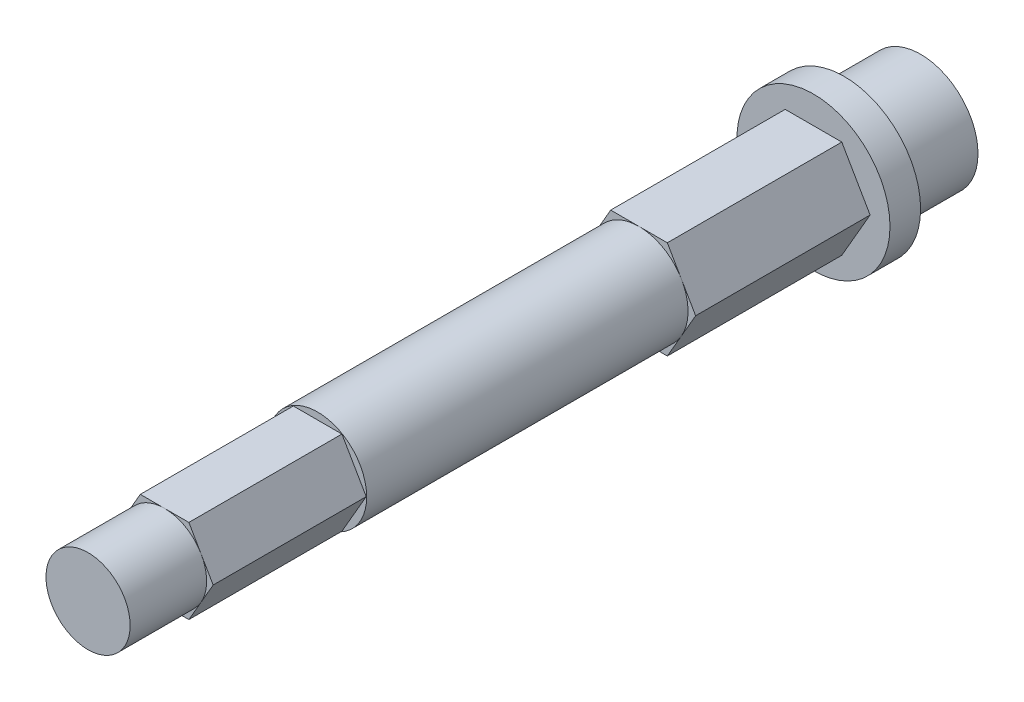
ISO-10303-21;
HEADER;
FILE_DESCRIPTION(('STEP AP214'),'2;1');
FILE_NAME('part.step','',(''),(''),'','','');
FILE_SCHEMA(('AUTOMOTIVE_DESIGN { 1 0 10303 214 1 1 1 1 }'));
ENDSEC;
DATA;
#1=APPLICATION_CONTEXT('core data for automotive mechanical design processes');
#2=APPLICATION_PROTOCOL_DEFINITION('international standard','automotive_design',2000,#1);
#3=PRODUCT_CONTEXT('',#1,'mechanical');
#4=PRODUCT('Part','Part','',(#3));
#5=PRODUCT_RELATED_PRODUCT_CATEGORY('part','',(#4));
#6=PRODUCT_DEFINITION_FORMATION('','',#4);
#7=PRODUCT_DEFINITION_CONTEXT('part definition',#1,'design');
#8=PRODUCT_DEFINITION('design','',#6,#7);
#9=PRODUCT_DEFINITION_SHAPE('','',#8);
#10=(LENGTH_UNIT() NAMED_UNIT(*) SI_UNIT(.MILLI.,.METRE.));
#11=(NAMED_UNIT(*) PLANE_ANGLE_UNIT() SI_UNIT($,.RADIAN.));
#12=(NAMED_UNIT(*) SI_UNIT($,.STERADIAN.) SOLID_ANGLE_UNIT());
#13=UNCERTAINTY_MEASURE_WITH_UNIT(LENGTH_MEASURE(1.E-05),#10,'distance_accuracy_value','');
#14=(GEOMETRIC_REPRESENTATION_CONTEXT(3) GLOBAL_UNCERTAINTY_ASSIGNED_CONTEXT((#13)) GLOBAL_UNIT_ASSIGNED_CONTEXT((#10,
#11,#12)) REPRESENTATION_CONTEXT('',''));
#15=CARTESIAN_POINT('',(0.,0.,0.));
#16=DIRECTION('',(0.,0.,1.));
#17=DIRECTION('',(1.,0.,0.));
#18=AXIS2_PLACEMENT_3D('',#15,#16,#17);
#19=CARTESIAN_POINT('',(0.,0.,49.4));
#20=DIRECTION('',(0.,0.,1.));
#21=DIRECTION('',(1.,0.,0.));
#22=AXIS2_PLACEMENT_3D('',#19,#20,#21);
#23=PLANE('',#22);
#24=CARTESIAN_POINT('',(0.,0.,49.4));
#25=DIRECTION('',(0.,0.,1.));
#26=DIRECTION('',(1.,0.,0.));
#27=AXIS2_PLACEMENT_3D('',#24,#25,#26);
#28=CIRCLE('',#27,2.74963065701559);
#29=CARTESIAN_POINT('',(2.38125,1.3748153285078,49.4));
#30=VERTEX_POINT('',#29);
#31=CARTESIAN_POINT('',(0.,2.74963065701559,49.4));
#32=VERTEX_POINT('',#31);
#33=EDGE_CURVE('E51',#30,#32,#28,.T.);
#34=ORIENTED_EDGE('',*,*,#33,.F.);
#35=DIRECTION('',(-0.5,0.866025403784439,0.));
#36=VECTOR('',#35,1.);
#37=CARTESIAN_POINT('',(3.175,0.,49.4));
#38=LINE('',#37,#36);
#39=CARTESIAN_POINT('',(1.5875,2.74963065701559,49.4));
#40=VERTEX_POINT('',#39);
#41=EDGE_CURVE('E181',#30,#40,#38,.T.);
#42=ORIENTED_EDGE('',*,*,#41,.T.);
#43=DIRECTION('',(-1.,0.,0.));
#44=VECTOR('',#43,1.);
#45=CARTESIAN_POINT('',(1.5875,2.74963065701559,49.4));
#46=LINE('',#45,#44);
#47=EDGE_CURVE('E195',#40,#32,#46,.T.);
#48=ORIENTED_EDGE('',*,*,#47,.T.);
#49=EDGE_LOOP('',(#34,#42,#48));
#50=FACE_BOUND('',#49,.T.);
#51=ADVANCED_FACE('F39',(#50),#23,.T.);
#52=CARTESIAN_POINT('',(-2.38125,1.3748153285078,49.4));
#53=VERTEX_POINT('',#52);
#54=EDGE_CURVE('E11',#32,#53,#28,.T.);
#55=ORIENTED_EDGE('',*,*,#54,.F.);
#56=CARTESIAN_POINT('',(-1.5875,2.74963065701559,49.4));
#57=VERTEX_POINT('',#56);
#58=EDGE_CURVE('E180',#32,#57,#46,.T.);
#59=ORIENTED_EDGE('',*,*,#58,.T.);
#60=DIRECTION('',(-0.5,-0.866025403784439,0.));
#61=VECTOR('',#60,1.);
#62=CARTESIAN_POINT('',(-1.5875,2.74963065701559,49.4));
#63=LINE('',#62,#61);
#64=EDGE_CURVE('E215',#57,#53,#63,.T.);
#65=ORIENTED_EDGE('',*,*,#64,.T.);
#66=EDGE_LOOP('',(#55,#59,#65));
#67=FACE_BOUND('',#66,.T.);
#68=ADVANCED_FACE('F389',(#67),#23,.T.);
#69=CARTESIAN_POINT('',(-2.38125,-1.3748153285078,49.4));
#70=VERTEX_POINT('',#69);
#71=EDGE_CURVE('E49',#53,#70,#28,.T.);
#72=ORIENTED_EDGE('',*,*,#71,.F.);
#73=CARTESIAN_POINT('',(-3.175,0.,49.4));
#74=VERTEX_POINT('',#73);
#75=EDGE_CURVE('E214',#53,#74,#63,.T.);
#76=ORIENTED_EDGE('',*,*,#75,.T.);
#77=DIRECTION('',(0.5,-0.866025403784439,0.));
#78=VECTOR('',#77,1.);
#79=CARTESIAN_POINT('',(-3.175,0.,49.4));
#80=LINE('',#79,#78);
#81=EDGE_CURVE('E220',#74,#70,#80,.T.);
#82=ORIENTED_EDGE('',*,*,#81,.T.);
#83=EDGE_LOOP('',(#72,#76,#82));
#84=FACE_BOUND('',#83,.T.);
#85=ADVANCED_FACE('F394',(#84),#23,.T.);
#86=CARTESIAN_POINT('',(0.,-2.74963065701559,49.4));
#87=VERTEX_POINT('',#86);
#88=EDGE_CURVE('E66',#70,#87,#28,.T.);
#89=ORIENTED_EDGE('',*,*,#88,.F.);
#90=CARTESIAN_POINT('',(-1.5875,-2.74963065701559,49.4));
#91=VERTEX_POINT('',#90);
#92=EDGE_CURVE('E219',#70,#91,#80,.T.);
#93=ORIENTED_EDGE('',*,*,#92,.T.);
#94=DIRECTION('',(1.,0.,0.));
#95=VECTOR('',#94,1.);
#96=CARTESIAN_POINT('',(-1.5875,-2.74963065701559,49.4));
#97=LINE('',#96,#95);
#98=EDGE_CURVE('E225',#91,#87,#97,.T.);
#99=ORIENTED_EDGE('',*,*,#98,.T.);
#100=EDGE_LOOP('',(#89,#93,#99));
#101=FACE_BOUND('',#100,.T.);
#102=ADVANCED_FACE('F411',(#101),#23,.T.);
#103=CARTESIAN_POINT('',(2.38125,-1.3748153285078,49.4));
#104=VERTEX_POINT('',#103);
#105=EDGE_CURVE('E58',#87,#104,#28,.T.);
#106=ORIENTED_EDGE('',*,*,#105,.F.);
#107=CARTESIAN_POINT('',(1.5875,-2.74963065701559,49.4));
#108=VERTEX_POINT('',#107);
#109=EDGE_CURVE('E224',#87,#108,#97,.T.);
#110=ORIENTED_EDGE('',*,*,#109,.T.);
#111=DIRECTION('',(0.5,0.866025403784439,0.));
#112=VECTOR('',#111,1.);
#113=CARTESIAN_POINT('',(1.5875,-2.74963065701559,49.4));
#114=LINE('',#113,#112);
#115=EDGE_CURVE('E193',#108,#104,#114,.T.);
#116=ORIENTED_EDGE('',*,*,#115,.T.);
#117=EDGE_LOOP('',(#106,#110,#116));
#118=FACE_BOUND('',#117,.T.);
#119=ADVANCED_FACE('F400',(#118),#23,.T.);
#120=CARTESIAN_POINT('',(0.,0.,18.4));
#121=DIRECTION('',(0.,0.,1.));
#122=DIRECTION('',(1.,0.,0.));
#123=AXIS2_PLACEMENT_3D('',#120,#121,#122);
#124=PLANE('',#123);
#125=CARTESIAN_POINT('',(0.,0.,18.4));
#126=DIRECTION('',(0.,0.,1.));
#127=DIRECTION('',(1.,0.,0.));
#128=AXIS2_PLACEMENT_3D('',#125,#126,#127);
#129=CIRCLE('',#128,3.20429399400242);
#130=CARTESIAN_POINT('',(2.775,1.60214699700121,18.4));
#131=VERTEX_POINT('',#130);
#132=CARTESIAN_POINT('',(0.,3.20429399400243,18.4));
#133=VERTEX_POINT('',#132);
#134=EDGE_CURVE('E207',#131,#133,#129,.T.);
#135=ORIENTED_EDGE('',*,*,#134,.F.);
#136=DIRECTION('',(-0.5,0.866025403784439,0.));
#137=VECTOR('',#136,1.);
#138=CARTESIAN_POINT('',(3.7,0.,18.4));
#139=LINE('',#138,#137);
#140=CARTESIAN_POINT('',(1.85,3.20429399400242,18.4));
#141=VERTEX_POINT('',#140);
#142=EDGE_CURVE('E284',#131,#141,#139,.T.);
#143=ORIENTED_EDGE('',*,*,#142,.T.);
#144=DIRECTION('',(-1.,0.,0.));
#145=VECTOR('',#144,1.);
#146=CARTESIAN_POINT('',(1.85,3.20429399400242,18.4));
#147=LINE('',#146,#145);
#148=EDGE_CURVE('E290',#141,#133,#147,.T.);
#149=ORIENTED_EDGE('',*,*,#148,.T.);
#150=EDGE_LOOP('',(#135,#143,#149));
#151=FACE_BOUND('',#150,.T.);
#152=ADVANCED_FACE('F410',(#151),#124,.T.);
#153=CARTESIAN_POINT('',(-2.775,1.60214699700121,18.4));
#154=VERTEX_POINT('',#153);
#155=EDGE_CURVE('E201',#133,#154,#129,.T.);
#156=ORIENTED_EDGE('',*,*,#155,.F.);
#157=CARTESIAN_POINT('',(-1.85,3.20429399400243,18.4));
#158=VERTEX_POINT('',#157);
#159=EDGE_CURVE('E289',#133,#158,#147,.T.);
#160=ORIENTED_EDGE('',*,*,#159,.T.);
#161=DIRECTION('',(-0.5,-0.866025403784439,0.));
#162=VECTOR('',#161,1.);
#163=CARTESIAN_POINT('',(-1.85,3.20429399400243,18.4));
#164=LINE('',#163,#162);
#165=EDGE_CURVE('E295',#158,#154,#164,.T.);
#166=ORIENTED_EDGE('',*,*,#165,.T.);
#167=EDGE_LOOP('',(#156,#160,#166));
#168=FACE_BOUND('',#167,.T.);
#169=ADVANCED_FACE('F416',(#168),#124,.T.);
#170=CARTESIAN_POINT('',(-2.775,-1.60214699700121,18.4));
#171=VERTEX_POINT('',#170);
#172=EDGE_CURVE('E205',#154,#171,#129,.T.);
#173=ORIENTED_EDGE('',*,*,#172,.F.);
#174=CARTESIAN_POINT('',(-3.7,0.,18.4));
#175=VERTEX_POINT('',#174);
#176=EDGE_CURVE('E294',#154,#175,#164,.T.);
#177=ORIENTED_EDGE('',*,*,#176,.T.);
#178=DIRECTION('',(0.5,-0.866025403784439,0.));
#179=VECTOR('',#178,1.);
#180=CARTESIAN_POINT('',(-3.7,0.,18.4));
#181=LINE('',#180,#179);
#182=EDGE_CURVE('E300',#175,#171,#181,.T.);
#183=ORIENTED_EDGE('',*,*,#182,.T.);
#184=EDGE_LOOP('',(#173,#177,#183));
#185=FACE_BOUND('',#184,.T.);
#186=ADVANCED_FACE('F642',(#185),#124,.T.);
#187=CARTESIAN_POINT('',(0.,-3.20429399400242,18.4));
#188=VERTEX_POINT('',#187);
#189=EDGE_CURVE('E714',#171,#188,#129,.T.);
#190=ORIENTED_EDGE('',*,*,#189,.F.);
#191=CARTESIAN_POINT('',(-1.85,-3.20429399400242,18.4));
#192=VERTEX_POINT('',#191);
#193=EDGE_CURVE('E299',#171,#192,#181,.T.);
#194=ORIENTED_EDGE('',*,*,#193,.T.);
#195=DIRECTION('',(1.,0.,0.));
#196=VECTOR('',#195,1.);
#197=CARTESIAN_POINT('',(-1.85,-3.20429399400242,18.4));
#198=LINE('',#197,#196);
#199=EDGE_CURVE('E305',#192,#188,#198,.T.);
#200=ORIENTED_EDGE('',*,*,#199,.T.);
#201=EDGE_LOOP('',(#190,#194,#200));
#202=FACE_BOUND('',#201,.T.);
#203=ADVANCED_FACE('F633',(#202),#124,.T.);
#204=CARTESIAN_POINT('',(2.775,-1.60214699700121,18.4));
#205=VERTEX_POINT('',#204);
#206=EDGE_CURVE('E371',#188,#205,#129,.T.);
#207=ORIENTED_EDGE('',*,*,#206,.F.);
#208=CARTESIAN_POINT('',(1.85,-3.20429399400243,18.4));
#209=VERTEX_POINT('',#208);
#210=EDGE_CURVE('E304',#188,#209,#198,.T.);
#211=ORIENTED_EDGE('',*,*,#210,.T.);
#212=DIRECTION('',(0.5,0.866025403784439,0.));
#213=VECTOR('',#212,1.);
#214=CARTESIAN_POINT('',(1.85,-3.20429399400243,18.4));
#215=LINE('',#214,#213);
#216=EDGE_CURVE('E280',#209,#205,#215,.T.);
#217=ORIENTED_EDGE('',*,*,#216,.T.);
#218=EDGE_LOOP('',(#207,#211,#217));
#219=FACE_BOUND('',#218,.T.);
#220=ADVANCED_FACE('F386',(#219),#124,.T.);
#221=CARTESIAN_POINT('',(0.,0.,5.));
#222=DIRECTION('',(0.,0.,-1.));
#223=DIRECTION('',(-1.,0.,0.));
#224=AXIS2_PLACEMENT_3D('',#221,#222,#223);
#225=CYLINDRICAL_SURFACE('',#224,3.75);
#226=CARTESIAN_POINT('',(0.,0.,5.));
#227=DIRECTION('',(0.,0.,1.));
#228=DIRECTION('',(1.,0.,0.));
#229=AXIS2_PLACEMENT_3D('',#226,#227,#228);
#230=CIRCLE('',#229,3.75);
#231=CARTESIAN_POINT('',(3.75,0.,5.));
#232=VERTEX_POINT('',#231);
#233=EDGE_CURVE('E363',#232,#232,#230,.T.);
#234=ORIENTED_EDGE('',*,*,#233,.F.);
#235=EDGE_LOOP('',(#234));
#236=FACE_BOUND('',#235,.T.);
#237=CARTESIAN_POINT('',(0.,0.,0.));
#238=DIRECTION('',(0.,0.,1.));
#239=DIRECTION('',(1.,0.,0.));
#240=AXIS2_PLACEMENT_3D('',#237,#238,#239);
#241=CIRCLE('',#240,3.75);
#242=CARTESIAN_POINT('',(3.75,0.,0.));
#243=VERTEX_POINT('',#242);
#244=EDGE_CURVE('E43',#243,#243,#241,.T.);
#245=ORIENTED_EDGE('',*,*,#244,.T.);
#246=EDGE_LOOP('',(#245));
#247=FACE_BOUND('',#246,.T.);
#248=ADVANCED_FACE('F41',(#236,#247),#225,.T.);
#249=CARTESIAN_POINT('',(0.,0.,0.));
#250=DIRECTION('',(0.,0.,1.));
#251=DIRECTION('',(1.,0.,0.));
#252=AXIS2_PLACEMENT_3D('',#249,#250,#251);
#253=PLANE('',#252);
#254=ORIENTED_EDGE('',*,*,#244,.F.);
#255=EDGE_LOOP('',(#254));
#256=FACE_BOUND('',#255,.T.);
#257=ADVANCED_FACE('F376',(#256),#253,.F.);
#258=CARTESIAN_POINT('',(0.,0.,7.));
#259=DIRECTION('',(0.,0.,-1.));
#260=DIRECTION('',(-1.,0.,0.));
#261=AXIS2_PLACEMENT_3D('',#258,#259,#260);
#262=CYLINDRICAL_SURFACE('',#261,5.);
#263=CARTESIAN_POINT('',(0.,0.,7.));
#264=DIRECTION('',(0.,0.,1.));
#265=DIRECTION('',(1.,0.,0.));
#266=AXIS2_PLACEMENT_3D('',#263,#264,#265);
#267=CIRCLE('',#266,5.);
#268=CARTESIAN_POINT('',(5.,0.,7.));
#269=VERTEX_POINT('',#268);
#270=EDGE_CURVE('E357',#269,#269,#267,.T.);
#271=ORIENTED_EDGE('',*,*,#270,.F.);
#272=EDGE_LOOP('',(#271));
#273=FACE_BOUND('',#272,.T.);
#274=CARTESIAN_POINT('',(0.,0.,5.));
#275=DIRECTION('',(0.,0.,1.));
#276=DIRECTION('',(1.,0.,0.));
#277=AXIS2_PLACEMENT_3D('',#274,#275,#276);
#278=CIRCLE('',#277,5.);
#279=CARTESIAN_POINT('',(5.,0.,5.));
#280=VERTEX_POINT('',#279);
#281=EDGE_CURVE('E356',#280,#280,#278,.T.);
#282=ORIENTED_EDGE('',*,*,#281,.T.);
#283=EDGE_LOOP('',(#282));
#284=FACE_BOUND('',#283,.T.);
#285=ADVANCED_FACE('F378',(#273,#284),#262,.T.);
#286=CARTESIAN_POINT('',(0.,0.,7.));
#287=DIRECTION('',(0.,0.,1.));
#288=DIRECTION('',(1.,0.,0.));
#289=AXIS2_PLACEMENT_3D('',#286,#287,#288);
#290=PLANE('',#289);
#291=DIRECTION('',(0.5,0.866025403784439,0.));
#292=VECTOR('',#291,1.);
#293=CARTESIAN_POINT('',(1.85,-3.20429399400243,7.));
#294=LINE('',#293,#292);
#295=CARTESIAN_POINT('',(1.85,-3.20429399400243,7.));
#296=VERTEX_POINT('',#295);
#297=CARTESIAN_POINT('',(3.7,0.,7.));
#298=VERTEX_POINT('',#297);
#299=EDGE_CURVE('E275',#296,#298,#294,.T.);
#300=ORIENTED_EDGE('',*,*,#299,.F.);
#301=DIRECTION('',(1.,0.,0.));
#302=VECTOR('',#301,1.);
#303=CARTESIAN_POINT('',(-1.85,-3.20429399400242,7.));
#304=LINE('',#303,#302);
#305=CARTESIAN_POINT('',(-1.85,-3.20429399400242,7.));
#306=VERTEX_POINT('',#305);
#307=EDGE_CURVE('E329',#306,#296,#304,.T.);
#308=ORIENTED_EDGE('',*,*,#307,.F.);
#309=DIRECTION('',(0.5,-0.866025403784439,0.));
#310=VECTOR('',#309,1.);
#311=CARTESIAN_POINT('',(-3.7,0.,7.));
#312=LINE('',#311,#310);
#313=CARTESIAN_POINT('',(-3.7,0.,7.));
#314=VERTEX_POINT('',#313);
#315=EDGE_CURVE('E325',#314,#306,#312,.T.);
#316=ORIENTED_EDGE('',*,*,#315,.F.);
#317=DIRECTION('',(-0.5,-0.866025403784439,0.));
#318=VECTOR('',#317,1.);
#319=CARTESIAN_POINT('',(-1.85,3.20429399400243,7.));
#320=LINE('',#319,#318);
#321=CARTESIAN_POINT('',(-1.85,3.20429399400243,7.));
#322=VERTEX_POINT('',#321);
#323=EDGE_CURVE('E321',#322,#314,#320,.T.);
#324=ORIENTED_EDGE('',*,*,#323,.F.);
#325=DIRECTION('',(-1.,0.,0.));
#326=VECTOR('',#325,1.);
#327=CARTESIAN_POINT('',(1.85,3.20429399400242,7.));
#328=LINE('',#327,#326);
#329=CARTESIAN_POINT('',(1.85,3.20429399400242,7.));
#330=VERTEX_POINT('',#329);
#331=EDGE_CURVE('E317',#330,#322,#328,.T.);
#332=ORIENTED_EDGE('',*,*,#331,.F.);
#333=DIRECTION('',(-0.5,0.866025403784439,0.));
#334=VECTOR('',#333,1.);
#335=CARTESIAN_POINT('',(3.7,0.,7.));
#336=LINE('',#335,#334);
#337=EDGE_CURVE('E313',#298,#330,#336,.T.);
#338=ORIENTED_EDGE('',*,*,#337,.F.);
#339=EDGE_LOOP('',(#300,#308,#316,#324,#332,#338));
#340=FACE_BOUND('',#339,.T.);
#341=ORIENTED_EDGE('',*,*,#270,.T.);
#342=EDGE_LOOP('',(#341));
#343=FACE_BOUND('',#342,.T.);
#344=ADVANCED_FACE('F383',(#340,#343),#290,.T.);
#345=CARTESIAN_POINT('',(0.,0.,5.));
#346=DIRECTION('',(0.,0.,1.));
#347=DIRECTION('',(1.,0.,0.));
#348=AXIS2_PLACEMENT_3D('',#345,#346,#347);
#349=PLANE('',#348);
#350=ORIENTED_EDGE('',*,*,#233,.T.);
#351=EDGE_LOOP('',(#350));
#352=FACE_BOUND('',#351,.T.);
#353=ORIENTED_EDGE('',*,*,#281,.F.);
#354=EDGE_LOOP('',(#353));
#355=FACE_BOUND('',#354,.T.);
#356=ADVANCED_FACE('F622',(#352,#355),#349,.F.);
#357=CARTESIAN_POINT('',(1.85,-3.20429399400243,18.4));
#358=DIRECTION('',(-0.866025403784439,0.5,0.));
#359=DIRECTION('',(-0.5,-0.866025403784439,0.));
#360=AXIS2_PLACEMENT_3D('',#357,#358,#359);
#361=PLANE('',#360);
#362=ORIENTED_EDGE('',*,*,#299,.T.);
#363=DIRECTION('',(0.,0.,-1.));
#364=VECTOR('',#363,1.);
#365=CARTESIAN_POINT('',(3.7,0.,18.4));
#366=LINE('',#365,#364);
#367=CARTESIAN_POINT('',(3.7,0.,18.4));
#368=VERTEX_POINT('',#367);
#369=EDGE_CURVE('E352',#368,#298,#366,.T.);
#370=ORIENTED_EDGE('',*,*,#369,.F.);
#371=EDGE_CURVE('E285',#205,#368,#215,.T.);
#372=ORIENTED_EDGE('',*,*,#371,.F.);
#373=ORIENTED_EDGE('',*,*,#216,.F.);
#374=DIRECTION('',(0.,0.,-1.));
#375=VECTOR('',#374,1.);
#376=CARTESIAN_POINT('',(1.85,-3.20429399400243,18.4));
#377=LINE('',#376,#375);
#378=EDGE_CURVE('E309',#209,#296,#377,.T.);
#379=ORIENTED_EDGE('',*,*,#378,.T.);
#380=EDGE_LOOP('',(#362,#370,#372,#373,#379));
#381=FACE_BOUND('',#380,.T.);
#382=ADVANCED_FACE('F612',(#381),#361,.F.);
#383=CARTESIAN_POINT('',(3.7,0.,18.4));
#384=DIRECTION('',(-0.866025403784439,-0.5,0.));
#385=DIRECTION('',(0.5,-0.866025403784439,0.));
#386=AXIS2_PLACEMENT_3D('',#383,#384,#385);
#387=PLANE('',#386);
#388=ORIENTED_EDGE('',*,*,#337,.T.);
#389=DIRECTION('',(0.,0.,-1.));
#390=VECTOR('',#389,1.);
#391=CARTESIAN_POINT('',(1.85,3.20429399400242,18.4));
#392=LINE('',#391,#390);
#393=EDGE_CURVE('E348',#141,#330,#392,.T.);
#394=ORIENTED_EDGE('',*,*,#393,.F.);
#395=ORIENTED_EDGE('',*,*,#142,.F.);
#396=EDGE_CURVE('E286',#368,#131,#139,.T.);
#397=ORIENTED_EDGE('',*,*,#396,.F.);
#398=ORIENTED_EDGE('',*,*,#369,.T.);
#399=EDGE_LOOP('',(#388,#394,#395,#397,#398));
#400=FACE_BOUND('',#399,.T.);
#401=ADVANCED_FACE('F602',(#400),#387,.F.);
#402=CARTESIAN_POINT('',(1.85,3.20429399400242,18.4));
#403=DIRECTION('',(0.,-1.,0.));
#404=DIRECTION('',(1.,0.,0.));
#405=AXIS2_PLACEMENT_3D('',#402,#403,#404);
#406=PLANE('',#405);
#407=ORIENTED_EDGE('',*,*,#331,.T.);
#408=DIRECTION('',(0.,0.,-1.));
#409=VECTOR('',#408,1.);
#410=CARTESIAN_POINT('',(-1.85,3.20429399400243,18.4));
#411=LINE('',#410,#409);
#412=EDGE_CURVE('E344',#158,#322,#411,.T.);
#413=ORIENTED_EDGE('',*,*,#412,.F.);
#414=ORIENTED_EDGE('',*,*,#159,.F.);
#415=ORIENTED_EDGE('',*,*,#148,.F.);
#416=ORIENTED_EDGE('',*,*,#393,.T.);
#417=EDGE_LOOP('',(#407,#413,#414,#415,#416));
#418=FACE_BOUND('',#417,.T.);
#419=ADVANCED_FACE('F592',(#418),#406,.F.);
#420=CARTESIAN_POINT('',(-1.85,3.20429399400243,18.4));
#421=DIRECTION('',(0.866025403784439,-0.5,0.));
#422=DIRECTION('',(0.5,0.866025403784439,0.));
#423=AXIS2_PLACEMENT_3D('',#420,#421,#422);
#424=PLANE('',#423);
#425=ORIENTED_EDGE('',*,*,#323,.T.);
#426=DIRECTION('',(0.,0.,-1.));
#427=VECTOR('',#426,1.);
#428=CARTESIAN_POINT('',(-3.7,0.,18.4));
#429=LINE('',#428,#427);
#430=EDGE_CURVE('E340',#175,#314,#429,.T.);
#431=ORIENTED_EDGE('',*,*,#430,.F.);
#432=ORIENTED_EDGE('',*,*,#176,.F.);
#433=ORIENTED_EDGE('',*,*,#165,.F.);
#434=ORIENTED_EDGE('',*,*,#412,.T.);
#435=EDGE_LOOP('',(#425,#431,#432,#433,#434));
#436=FACE_BOUND('',#435,.T.);
#437=ADVANCED_FACE('F582',(#436),#424,.F.);
#438=CARTESIAN_POINT('',(-3.7,0.,18.4));
#439=DIRECTION('',(0.866025403784439,0.5,0.));
#440=DIRECTION('',(-0.5,0.866025403784439,0.));
#441=AXIS2_PLACEMENT_3D('',#438,#439,#440);
#442=PLANE('',#441);
#443=ORIENTED_EDGE('',*,*,#315,.T.);
#444=DIRECTION('',(0.,0.,-1.));
#445=VECTOR('',#444,1.);
#446=CARTESIAN_POINT('',(-1.85,-3.20429399400242,18.4));
#447=LINE('',#446,#445);
#448=EDGE_CURVE('E336',#192,#306,#447,.T.);
#449=ORIENTED_EDGE('',*,*,#448,.F.);
#450=ORIENTED_EDGE('',*,*,#193,.F.);
#451=ORIENTED_EDGE('',*,*,#182,.F.);
#452=ORIENTED_EDGE('',*,*,#430,.T.);
#453=EDGE_LOOP('',(#443,#449,#450,#451,#452));
#454=FACE_BOUND('',#453,.T.);
#455=ADVANCED_FACE('F572',(#454),#442,.F.);
#456=CARTESIAN_POINT('',(-1.85,-3.20429399400242,18.4));
#457=DIRECTION('',(0.,1.,0.));
#458=DIRECTION('',(-1.,0.,0.));
#459=AXIS2_PLACEMENT_3D('',#456,#457,#458);
#460=PLANE('',#459);
#461=ORIENTED_EDGE('',*,*,#307,.T.);
#462=ORIENTED_EDGE('',*,*,#378,.F.);
#463=ORIENTED_EDGE('',*,*,#210,.F.);
#464=ORIENTED_EDGE('',*,*,#199,.F.);
#465=ORIENTED_EDGE('',*,*,#448,.T.);
#466=EDGE_LOOP('',(#461,#462,#463,#464,#465));
#467=FACE_BOUND('',#466,.T.);
#468=ADVANCED_FACE('F562',(#467),#460,.F.);
#469=EDGE_CURVE('E279',#205,#131,#129,.T.);
#470=ORIENTED_EDGE('',*,*,#469,.F.);
#471=ORIENTED_EDGE('',*,*,#371,.T.);
#472=ORIENTED_EDGE('',*,*,#396,.T.);
#473=EDGE_LOOP('',(#470,#471,#472));
#474=FACE_BOUND('',#473,.T.);
#475=ADVANCED_FACE('F419',(#474),#124,.T.);
#476=CARTESIAN_POINT('',(0.,0.,39.4));
#477=DIRECTION('',(0.,0.,-1.));
#478=DIRECTION('',(-1.,0.,0.));
#479=AXIS2_PLACEMENT_3D('',#476,#477,#478);
#480=CYLINDRICAL_SURFACE('',#479,3.20429399400242);
#481=CARTESIAN_POINT('',(0.,0.,39.4));
#482=DIRECTION('',(0.,0.,1.));
#483=DIRECTION('',(1.,0.,0.));
#484=AXIS2_PLACEMENT_3D('',#481,#482,#483);
#485=CIRCLE('',#484,3.20429399400242);
#486=CARTESIAN_POINT('',(3.20429399400242,0.,39.4));
#487=VERTEX_POINT('',#486);
#488=EDGE_CURVE('E272',#487,#487,#485,.T.);
#489=ORIENTED_EDGE('',*,*,#488,.F.);
#490=EDGE_LOOP('',(#489));
#491=FACE_BOUND('',#490,.T.);
#492=ORIENTED_EDGE('',*,*,#134,.T.);
#493=ORIENTED_EDGE('',*,*,#155,.T.);
#494=ORIENTED_EDGE('',*,*,#172,.T.);
#495=ORIENTED_EDGE('',*,*,#189,.T.);
#496=ORIENTED_EDGE('',*,*,#206,.T.);
#497=ORIENTED_EDGE('',*,*,#469,.T.);
#498=EDGE_LOOP('',(#492,#493,#494,#495,#496,#497));
#499=FACE_BOUND('',#498,.T.);
#500=ADVANCED_FACE('F543',(#491,#499),#480,.T.);
#501=CARTESIAN_POINT('',(0.,0.,39.4));
#502=DIRECTION('',(0.,0.,1.));
#503=DIRECTION('',(1.,0.,0.));
#504=AXIS2_PLACEMENT_3D('',#501,#502,#503);
#505=PLANE('',#504);
#506=DIRECTION('',(0.5,0.866025403784439,0.));
#507=VECTOR('',#506,1.);
#508=CARTESIAN_POINT('',(1.5875,-2.74963065701559,39.4));
#509=LINE('',#508,#507);
#510=CARTESIAN_POINT('',(1.5875,-2.74963065701559,39.4));
#511=VERTEX_POINT('',#510);
#512=CARTESIAN_POINT('',(3.175,0.,39.4));
#513=VERTEX_POINT('',#512);
#514=EDGE_CURVE('E229',#511,#513,#509,.T.);
#515=ORIENTED_EDGE('',*,*,#514,.F.);
#516=DIRECTION('',(1.,0.,0.));
#517=VECTOR('',#516,1.);
#518=CARTESIAN_POINT('',(-1.5875,-2.74963065701559,39.4));
#519=LINE('',#518,#517);
#520=CARTESIAN_POINT('',(-1.5875,-2.74963065701559,39.4));
#521=VERTEX_POINT('',#520);
#522=EDGE_CURVE('E248',#521,#511,#519,.T.);
#523=ORIENTED_EDGE('',*,*,#522,.F.);
#524=DIRECTION('',(0.5,-0.866025403784439,0.));
#525=VECTOR('',#524,1.);
#526=CARTESIAN_POINT('',(-3.175,0.,39.4));
#527=LINE('',#526,#525);
#528=CARTESIAN_POINT('',(-3.175,0.,39.4));
#529=VERTEX_POINT('',#528);
#530=EDGE_CURVE('E244',#529,#521,#527,.T.);
#531=ORIENTED_EDGE('',*,*,#530,.F.);
#532=DIRECTION('',(-0.5,-0.866025403784439,0.));
#533=VECTOR('',#532,1.);
#534=CARTESIAN_POINT('',(-1.5875,2.74963065701559,39.4));
#535=LINE('',#534,#533);
#536=CARTESIAN_POINT('',(-1.5875,2.74963065701559,39.4));
#537=VERTEX_POINT('',#536);
#538=EDGE_CURVE('E240',#537,#529,#535,.T.);
#539=ORIENTED_EDGE('',*,*,#538,.F.);
#540=DIRECTION('',(-1.,0.,0.));
#541=VECTOR('',#540,1.);
#542=CARTESIAN_POINT('',(1.5875,2.74963065701559,39.4));
#543=LINE('',#542,#541);
#544=CARTESIAN_POINT('',(1.5875,2.74963065701559,39.4));
#545=VERTEX_POINT('',#544);
#546=EDGE_CURVE('E236',#545,#537,#543,.T.);
#547=ORIENTED_EDGE('',*,*,#546,.F.);
#548=DIRECTION('',(-0.5,0.866025403784439,0.));
#549=VECTOR('',#548,1.);
#550=CARTESIAN_POINT('',(3.175,0.,39.4));
#551=LINE('',#550,#549);
#552=EDGE_CURVE('E233',#513,#545,#551,.T.);
#553=ORIENTED_EDGE('',*,*,#552,.F.);
#554=EDGE_LOOP('',(#515,#523,#531,#539,#547,#553));
#555=FACE_BOUND('',#554,.T.);
#556=ORIENTED_EDGE('',*,*,#488,.T.);
#557=EDGE_LOOP('',(#556));
#558=FACE_BOUND('',#557,.T.);
#559=ADVANCED_FACE('F512',(#555,#558),#505,.T.);
#560=CARTESIAN_POINT('',(1.5875,-2.74963065701559,49.4));
#561=DIRECTION('',(-0.866025403784439,0.5,0.));
#562=DIRECTION('',(-0.5,-0.866025403784439,0.));
#563=AXIS2_PLACEMENT_3D('',#560,#561,#562);
#564=PLANE('',#563);
#565=ORIENTED_EDGE('',*,*,#514,.T.);
#566=DIRECTION('',(0.,0.,-1.));
#567=VECTOR('',#566,1.);
#568=CARTESIAN_POINT('',(3.175,0.,49.4));
#569=LINE('',#568,#567);
#570=CARTESIAN_POINT('',(3.175,0.,49.4));
#571=VERTEX_POINT('',#570);
#572=EDGE_CURVE('E269',#571,#513,#569,.T.);
#573=ORIENTED_EDGE('',*,*,#572,.F.);
#574=EDGE_CURVE('E175',#104,#571,#114,.T.);
#575=ORIENTED_EDGE('',*,*,#574,.F.);
#576=ORIENTED_EDGE('',*,*,#115,.F.);
#577=DIRECTION('',(0.,0.,-1.));
#578=VECTOR('',#577,1.);
#579=CARTESIAN_POINT('',(1.5875,-2.74963065701559,49.4));
#580=LINE('',#579,#578);
#581=EDGE_CURVE('E228',#108,#511,#580,.T.);
#582=ORIENTED_EDGE('',*,*,#581,.T.);
#583=EDGE_LOOP('',(#565,#573,#575,#576,#582));
#584=FACE_BOUND('',#583,.T.);
#585=ADVANCED_FACE('F504',(#584),#564,.F.);
#586=CARTESIAN_POINT('',(3.175,0.,49.4));
#587=DIRECTION('',(-0.866025403784439,-0.5,0.));
#588=DIRECTION('',(0.5,-0.866025403784439,0.));
#589=AXIS2_PLACEMENT_3D('',#586,#587,#588);
#590=PLANE('',#589);
#591=ORIENTED_EDGE('',*,*,#552,.T.);
#592=DIRECTION('',(0.,0.,-1.));
#593=VECTOR('',#592,1.);
#594=CARTESIAN_POINT('',(1.5875,2.74963065701559,49.4));
#595=LINE('',#594,#593);
#596=EDGE_CURVE('E188',#40,#545,#595,.T.);
#597=ORIENTED_EDGE('',*,*,#596,.F.);
#598=ORIENTED_EDGE('',*,*,#41,.F.);
#599=EDGE_CURVE('E169',#571,#30,#38,.T.);
#600=ORIENTED_EDGE('',*,*,#599,.F.);
#601=ORIENTED_EDGE('',*,*,#572,.T.);
#602=EDGE_LOOP('',(#591,#597,#598,#600,#601));
#603=FACE_BOUND('',#602,.T.);
#604=ADVANCED_FACE('F186',(#603),#590,.F.);
#605=CARTESIAN_POINT('',(1.5875,2.74963065701559,49.4));
#606=DIRECTION('',(0.,-1.,0.));
#607=DIRECTION('',(1.,0.,0.));
#608=AXIS2_PLACEMENT_3D('',#605,#606,#607);
#609=PLANE('',#608);
#610=ORIENTED_EDGE('',*,*,#546,.T.);
#611=DIRECTION('',(0.,0.,-1.));
#612=VECTOR('',#611,1.);
#613=CARTESIAN_POINT('',(-1.5875,2.74963065701559,49.4));
#614=LINE('',#613,#612);
#615=EDGE_CURVE('E263',#57,#537,#614,.T.);
#616=ORIENTED_EDGE('',*,*,#615,.F.);
#617=ORIENTED_EDGE('',*,*,#58,.F.);
#618=ORIENTED_EDGE('',*,*,#47,.F.);
#619=ORIENTED_EDGE('',*,*,#596,.T.);
#620=EDGE_LOOP('',(#610,#616,#617,#618,#619));
#621=FACE_BOUND('',#620,.T.);
#622=ADVANCED_FACE('F439',(#621),#609,.F.);
#623=CARTESIAN_POINT('',(-1.5875,2.74963065701559,49.4));
#624=DIRECTION('',(0.866025403784439,-0.5,0.));
#625=DIRECTION('',(0.5,0.866025403784439,0.));
#626=AXIS2_PLACEMENT_3D('',#623,#624,#625);
#627=PLANE('',#626);
#628=ORIENTED_EDGE('',*,*,#538,.T.);
#629=DIRECTION('',(0.,0.,-1.));
#630=VECTOR('',#629,1.);
#631=CARTESIAN_POINT('',(-3.175,0.,49.4));
#632=LINE('',#631,#630);
#633=EDGE_CURVE('E259',#74,#529,#632,.T.);
#634=ORIENTED_EDGE('',*,*,#633,.F.);
#635=ORIENTED_EDGE('',*,*,#75,.F.);
#636=ORIENTED_EDGE('',*,*,#64,.F.);
#637=ORIENTED_EDGE('',*,*,#615,.T.);
#638=EDGE_LOOP('',(#628,#634,#635,#636,#637));
#639=FACE_BOUND('',#638,.T.);
#640=ADVANCED_FACE('F433',(#639),#627,.F.);
#641=CARTESIAN_POINT('',(-3.175,0.,49.4));
#642=DIRECTION('',(0.866025403784439,0.5,0.));
#643=DIRECTION('',(-0.5,0.866025403784439,0.));
#644=AXIS2_PLACEMENT_3D('',#641,#642,#643);
#645=PLANE('',#644);
#646=ORIENTED_EDGE('',*,*,#530,.T.);
#647=DIRECTION('',(0.,0.,-1.));
#648=VECTOR('',#647,1.);
#649=CARTESIAN_POINT('',(-1.5875,-2.74963065701559,49.4));
#650=LINE('',#649,#648);
#651=EDGE_CURVE('E255',#91,#521,#650,.T.);
#652=ORIENTED_EDGE('',*,*,#651,.F.);
#653=ORIENTED_EDGE('',*,*,#92,.F.);
#654=ORIENTED_EDGE('',*,*,#81,.F.);
#655=ORIENTED_EDGE('',*,*,#633,.T.);
#656=EDGE_LOOP('',(#646,#652,#653,#654,#655));
#657=FACE_BOUND('',#656,.T.);
#658=ADVANCED_FACE('F407',(#657),#645,.F.);
#659=CARTESIAN_POINT('',(-1.5875,-2.74963065701559,49.4));
#660=DIRECTION('',(0.,1.,0.));
#661=DIRECTION('',(-1.,0.,0.));
#662=AXIS2_PLACEMENT_3D('',#659,#660,#661);
#663=PLANE('',#662);
#664=ORIENTED_EDGE('',*,*,#522,.T.);
#665=ORIENTED_EDGE('',*,*,#581,.F.);
#666=ORIENTED_EDGE('',*,*,#109,.F.);
#667=ORIENTED_EDGE('',*,*,#98,.F.);
#668=ORIENTED_EDGE('',*,*,#651,.T.);
#669=EDGE_LOOP('',(#664,#665,#666,#667,#668));
#670=FACE_BOUND('',#669,.T.);
#671=ADVANCED_FACE('F399',(#670),#663,.F.);
#672=EDGE_CURVE('E173',#104,#30,#28,.T.);
#673=ORIENTED_EDGE('',*,*,#672,.F.);
#674=ORIENTED_EDGE('',*,*,#574,.T.);
#675=ORIENTED_EDGE('',*,*,#599,.T.);
#676=EDGE_LOOP('',(#673,#674,#675));
#677=FACE_BOUND('',#676,.T.);
#678=ADVANCED_FACE('F171',(#677),#23,.T.);
#679=CARTESIAN_POINT('',(0.,0.,54.4));
#680=DIRECTION('',(0.,0.,-1.));
#681=DIRECTION('',(-1.,0.,0.));
#682=AXIS2_PLACEMENT_3D('',#679,#680,#681);
#683=CYLINDRICAL_SURFACE('',#682,2.74963065701559);
#684=CARTESIAN_POINT('',(0.,0.,54.4));
#685=DIRECTION('',(0.,0.,1.));
#686=DIRECTION('',(1.,0.,0.));
#687=AXIS2_PLACEMENT_3D('',#684,#685,#686);
#688=CIRCLE('',#687,2.74963065701559);
#689=CARTESIAN_POINT('',(2.74963065701559,0.,54.4));
#690=VERTEX_POINT('',#689);
#691=EDGE_CURVE('E198',#690,#690,#688,.T.);
#692=ORIENTED_EDGE('',*,*,#691,.F.);
#693=EDGE_LOOP('',(#692));
#694=FACE_BOUND('',#693,.T.);
#695=ORIENTED_EDGE('',*,*,#33,.T.);
#696=ORIENTED_EDGE('',*,*,#54,.T.);
#697=ORIENTED_EDGE('',*,*,#71,.T.);
#698=ORIENTED_EDGE('',*,*,#88,.T.);
#699=ORIENTED_EDGE('',*,*,#105,.T.);
#700=ORIENTED_EDGE('',*,*,#672,.T.);
#701=EDGE_LOOP('',(#695,#696,#697,#698,#699,#700));
#702=FACE_BOUND('',#701,.T.);
#703=ADVANCED_FACE('F199',(#694,#702),#683,.T.);
#704=CARTESIAN_POINT('',(0.,0.,54.4));
#705=DIRECTION('',(0.,0.,1.));
#706=DIRECTION('',(1.,0.,0.));
#707=AXIS2_PLACEMENT_3D('',#704,#705,#706);
#708=PLANE('',#707);
#709=ORIENTED_EDGE('',*,*,#691,.T.);
#710=EDGE_LOOP('',(#709));
#711=FACE_BOUND('',#710,.T.);
#712=ADVANCED_FACE('F405',(#711),#708,.T.);
#713=CLOSED_SHELL('',(#51,#68,#85,#102,#119,#152,#169,#186,#203,#220,#248,#257,#285,#344,#356,
#382,#401,#419,#437,#455,#468,#475,#500,#559,#585,#604,#622,#640,#658,#671,#678,#703,#712));
#714=MANIFOLD_SOLID_BREP('B2',#713);
#715=ADVANCED_BREP_SHAPE_REPRESENTATION('',(#18,#714),#14);
#716=SHAPE_DEFINITION_REPRESENTATION(#9,#715);
ENDSEC;
END-ISO-10303-21;
